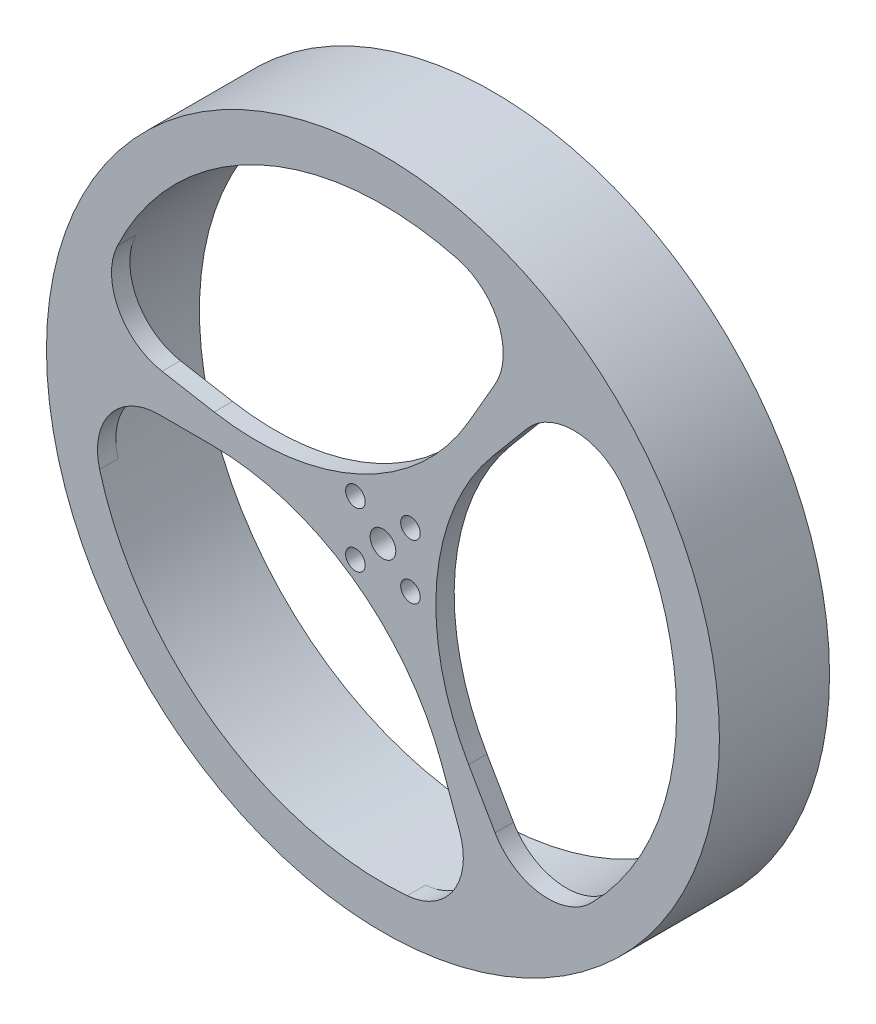
ISO-10303-21;
HEADER;
FILE_DESCRIPTION(('STEP AP214'),'2;1');
FILE_NAME('part.step','',(''),(''),'','','');
FILE_SCHEMA(('AUTOMOTIVE_DESIGN { 1 0 10303 214 1 1 1 1 }'));
ENDSEC;
DATA;
#1=APPLICATION_CONTEXT('core data for automotive mechanical design processes');
#2=APPLICATION_PROTOCOL_DEFINITION('international standard','automotive_design',2000,#1);
#3=PRODUCT_CONTEXT('',#1,'mechanical');
#4=PRODUCT('Part','Part','',(#3));
#5=PRODUCT_RELATED_PRODUCT_CATEGORY('part','',(#4));
#6=PRODUCT_DEFINITION_FORMATION('','',#4);
#7=PRODUCT_DEFINITION_CONTEXT('part definition',#1,'design');
#8=PRODUCT_DEFINITION('design','',#6,#7);
#9=PRODUCT_DEFINITION_SHAPE('','',#8);
#10=(LENGTH_UNIT() NAMED_UNIT(*) SI_UNIT(.MILLI.,.METRE.));
#11=(NAMED_UNIT(*) PLANE_ANGLE_UNIT() SI_UNIT($,.RADIAN.));
#12=(NAMED_UNIT(*) SI_UNIT($,.STERADIAN.) SOLID_ANGLE_UNIT());
#13=UNCERTAINTY_MEASURE_WITH_UNIT(LENGTH_MEASURE(1.E-05),#10,'distance_accuracy_value','');
#14=(GEOMETRIC_REPRESENTATION_CONTEXT(3) GLOBAL_UNCERTAINTY_ASSIGNED_CONTEXT((#13)) GLOBAL_UNIT_ASSIGNED_CONTEXT((#10,
#11,#12)) REPRESENTATION_CONTEXT('',''));
#15=CARTESIAN_POINT('',(0.,0.,0.));
#16=DIRECTION('',(0.,0.,1.));
#17=DIRECTION('',(1.,0.,0.));
#18=AXIS2_PLACEMENT_3D('',#15,#16,#17);
#19=CARTESIAN_POINT('',(0.,0.,0.));
#20=DIRECTION('',(0.,0.,1.));
#21=DIRECTION('',(1.,0.,0.));
#22=AXIS2_PLACEMENT_3D('',#19,#20,#21);
#23=PLANE('',#22);
#24=CARTESIAN_POINT('',(0.,0.,0.));
#25=DIRECTION('',(0.,0.,1.));
#26=DIRECTION('',(1.,0.,0.));
#27=AXIS2_PLACEMENT_3D('',#24,#25,#26);
#28=CIRCLE('',#27,55.);
#29=CARTESIAN_POINT('',(55.,0.,0.));
#30=VERTEX_POINT('',#29);
#31=EDGE_CURVE('E370',#30,#30,#28,.T.);
#32=ORIENTED_EDGE('',*,*,#31,.F.);
#33=EDGE_LOOP('',(#32));
#34=FACE_BOUND('',#33,.T.);
#35=CARTESIAN_POINT('',(0.,0.,0.));
#36=DIRECTION('',(0.,0.,1.));
#37=DIRECTION('',(1.,0.,0.));
#38=AXIS2_PLACEMENT_3D('',#35,#36,#37);
#39=CIRCLE('',#38,48.);
#40=CARTESIAN_POINT('',(48.,0.,0.));
#41=VERTEX_POINT('',#40);
#42=EDGE_CURVE('E349',#41,#41,#39,.F.);
#43=ORIENTED_EDGE('',*,*,#42,.F.);
#44=EDGE_LOOP('',(#43));
#45=FACE_BOUND('',#44,.T.);
#46=ADVANCED_FACE('F84',(#34,#45),#23,.F.);
#47=CARTESIAN_POINT('',(0.,0.,18.));
#48=DIRECTION('',(0.,0.,1.));
#49=DIRECTION('',(1.,0.,0.));
#50=AXIS2_PLACEMENT_3D('',#47,#48,#49);
#51=PLANE('',#50);
#52=CARTESIAN_POINT('',(4.49999999999996,-4.50000000000005,18.));
#53=DIRECTION('',(0.,0.,1.));
#54=DIRECTION('',(1.,0.,0.));
#55=AXIS2_PLACEMENT_3D('',#52,#53,#54);
#56=CIRCLE('',#55,1.6);
#57=CARTESIAN_POINT('',(6.09999999999996,-4.50000000000005,18.));
#58=VERTEX_POINT('',#57);
#59=EDGE_CURVE('E658',#58,#58,#56,.T.);
#60=ORIENTED_EDGE('',*,*,#59,.F.);
#61=EDGE_LOOP('',(#60));
#62=FACE_BOUND('',#61,.T.);
#63=CARTESIAN_POINT('',(4.50000000000003,4.49999999999997,18.));
#64=DIRECTION('',(0.,0.,1.));
#65=DIRECTION('',(1.,0.,0.));
#66=AXIS2_PLACEMENT_3D('',#63,#64,#65);
#67=CIRCLE('',#66,1.6);
#68=CARTESIAN_POINT('',(6.10000000000003,4.49999999999997,18.));
#69=VERTEX_POINT('',#68);
#70=EDGE_CURVE('E659',#69,#69,#67,.T.);
#71=ORIENTED_EDGE('',*,*,#70,.F.);
#72=EDGE_LOOP('',(#71));
#73=FACE_BOUND('',#72,.T.);
#74=CARTESIAN_POINT('',(-4.49999999999999,4.50000000000002,18.));
#75=DIRECTION('',(0.,0.,1.));
#76=DIRECTION('',(1.,0.,0.));
#77=AXIS2_PLACEMENT_3D('',#74,#75,#76);
#78=CIRCLE('',#77,1.6);
#79=CARTESIAN_POINT('',(-2.89999999999999,4.50000000000002,18.));
#80=VERTEX_POINT('',#79);
#81=EDGE_CURVE('E662',#80,#80,#78,.T.);
#82=ORIENTED_EDGE('',*,*,#81,.F.);
#83=EDGE_LOOP('',(#82));
#84=FACE_BOUND('',#83,.T.);
#85=CARTESIAN_POINT('',(-4.5,-4.5,18.));
#86=DIRECTION('',(0.,0.,1.));
#87=DIRECTION('',(1.,0.,0.));
#88=AXIS2_PLACEMENT_3D('',#85,#86,#87);
#89=CIRCLE('',#88,1.6);
#90=CARTESIAN_POINT('',(-2.9,-4.5,18.));
#91=VERTEX_POINT('',#90);
#92=EDGE_CURVE('E313',#91,#91,#89,.T.);
#93=ORIENTED_EDGE('',*,*,#92,.F.);
#94=EDGE_LOOP('',(#93));
#95=FACE_BOUND('',#94,.T.);
#96=CARTESIAN_POINT('',(0.,0.,18.));
#97=DIRECTION('',(0.,0.,1.));
#98=DIRECTION('',(1.,0.,0.));
#99=AXIS2_PLACEMENT_3D('',#96,#97,#98);
#100=CIRCLE('',#99,2.1);
#101=CARTESIAN_POINT('',(2.1,0.,18.));
#102=VERTEX_POINT('',#101);
#103=EDGE_CURVE('E367',#102,#102,#100,.T.);
#104=ORIENTED_EDGE('',*,*,#103,.F.);
#105=EDGE_LOOP('',(#104));
#106=FACE_BOUND('',#105,.T.);
#107=CARTESIAN_POINT('',(0.,0.,18.));
#108=DIRECTION('',(0.,0.,1.));
#109=DIRECTION('',(1.,0.,0.));
#110=AXIS2_PLACEMENT_3D('',#107,#108,#109);
#111=CIRCLE('',#110,55.);
#112=CARTESIAN_POINT('',(55.,0.,18.));
#113=VERTEX_POINT('',#112);
#114=EDGE_CURVE('E371',#113,#113,#111,.T.);
#115=ORIENTED_EDGE('',*,*,#114,.T.);
#116=EDGE_LOOP('',(#115));
#117=FACE_BOUND('',#116,.T.);
#118=DIRECTION('',(-1.,0.,0.));
#119=VECTOR('',#118,1.);
#120=CARTESIAN_POINT('',(0.,0.,18.));
#121=LINE('',#120,#119);
#122=CARTESIAN_POINT('',(-28.0083015283884,0.,18.));
#123=VERTEX_POINT('',#122);
#124=CARTESIAN_POINT('',(-36.6606055596467,0.,18.));
#125=VERTEX_POINT('',#124);
#126=EDGE_CURVE('E352',#123,#125,#121,.T.);
#127=ORIENTED_EDGE('',*,*,#126,.F.);
#128=CARTESIAN_POINT('',(-28.0083015283884,-40.,18.));
#129=DIRECTION('',(0.,0.,1.));
#130=DIRECTION('',(1.,0.,0.));
#131=AXIS2_PLACEMENT_3D('',#128,#129,#130);
#132=CIRCLE('',#131,40.);
#133=CARTESIAN_POINT('',(9.57940330304794,-26.3191942669733,18.));
#134=VERTEX_POINT('',#133);
#135=EDGE_CURVE('E12',#123,#134,#132,.F.);
#136=ORIENTED_EDGE('',*,*,#135,.T.);
#137=DIRECTION('',(-0.342020143325668,0.939692620785909,0.));
#138=VECTOR('',#137,1.);
#139=CARTESIAN_POINT('',(0.,0.,18.));
#140=LINE('',#139,#138);
#141=CARTESIAN_POINT('',(12.5386655679162,-34.4497005179429,18.));
#142=VERTEX_POINT('',#141);
#143=EDGE_CURVE('E364',#142,#134,#140,.T.);
#144=ORIENTED_EDGE('',*,*,#143,.F.);
#145=CARTESIAN_POINT('',(3.14173936005708,-37.8699019511996,18.));
#146=DIRECTION('',(0.,0.,1.));
#147=DIRECTION('',(1.,0.,0.));
#148=AXIS2_PLACEMENT_3D('',#145,#146,#147);
#149=CIRCLE('',#148,10.);
#150=CARTESIAN_POINT('',(3.96851287586158,-47.8356656225679,18.));
#151=VERTEX_POINT('',#150);
#152=EDGE_CURVE('E256',#142,#151,#149,.F.);
#153=ORIENTED_EDGE('',*,*,#152,.T.);
#154=CARTESIAN_POINT('',(0.,0.,18.));
#155=DIRECTION('',(0.,0.,1.));
#156=DIRECTION('',(1.,0.,0.));
#157=AXIS2_PLACEMENT_3D('',#154,#155,#156);
#158=CIRCLE('',#157,48.);
#159=CARTESIAN_POINT('',(-46.3081333385011,-12.6315789473684,18.));
#160=VERTEX_POINT('',#159);
#161=EDGE_CURVE('E361',#151,#160,#158,.F.);
#162=ORIENTED_EDGE('',*,*,#161,.T.);
#163=CARTESIAN_POINT('',(-36.6606055596467,-10.,18.));
#164=DIRECTION('',(0.,0.,1.));
#165=DIRECTION('',(1.,0.,0.));
#166=AXIS2_PLACEMENT_3D('',#163,#164,#165);
#167=CIRCLE('',#166,10.);
#168=EDGE_CURVE('E261',#160,#125,#167,.F.);
#169=ORIENTED_EDGE('',*,*,#168,.T.);
#170=EDGE_LOOP('',(#127,#136,#144,#153,#162,#169));
#171=FACE_BOUND('',#170,.T.);
#172=DIRECTION('',(0.5,0.866025403784439,0.));
#173=VECTOR('',#172,1.);
#174=CARTESIAN_POINT('',(0.,0.,18.));
#175=LINE('',#174,#173);
#176=CARTESIAN_POINT('',(14.0041507641942,24.2559006404389,18.));
#177=VERTEX_POINT('',#176);
#178=CARTESIAN_POINT('',(18.3303027798234,31.7490157327751,18.));
#179=VERTEX_POINT('',#178);
#180=EDGE_CURVE('E353',#177,#179,#175,.T.);
#181=ORIENTED_EDGE('',*,*,#180,.F.);
#182=CARTESIAN_POINT('',(-20.6368653871833,44.2559006404389,18.));
#183=DIRECTION('',(0.,0.,1.));
#184=DIRECTION('',(1.,0.,0.));
#185=AXIS2_PLACEMENT_3D('',#182,#183,#184);
#186=CIRCLE('',#185,40.);
#187=CARTESIAN_POINT('',(-27.5827924938605,4.86359051995055,18.));
#188=VERTEX_POINT('',#187);
#189=EDGE_CURVE('E302',#177,#188,#186,.F.);
#190=ORIENTED_EDGE('',*,*,#189,.T.);
#191=DIRECTION('',(0.984807753012208,-0.173648177666931,0.));
#192=VECTOR('',#191,1.);
#193=CARTESIAN_POINT('',(0.,0.,18.));
#194=LINE('',#193,#192);
#195=CARTESIAN_POINT('',(-36.1036485852626,6.3660473475988,18.));
#196=VERTEX_POINT('',#195);
#197=EDGE_CURVE('E356',#196,#188,#194,.T.);
#198=ORIENTED_EDGE('',*,*,#197,.F.);
#199=CARTESIAN_POINT('',(-34.3671668085933,16.2141248777209,18.));
#200=DIRECTION('',(0.,0.,1.));
#201=DIRECTION('',(1.,0.,0.));
#202=AXIS2_PLACEMENT_3D('',#199,#200,#201);
#203=CIRCLE('',#202,10.);
#204=CARTESIAN_POINT('',(-43.4111580740125,20.4809998455422,18.));
#205=VERTEX_POINT('',#204);
#206=EDGE_CURVE('E267',#196,#205,#203,.F.);
#207=ORIENTED_EDGE('',*,*,#206,.T.);
#208=CARTESIAN_POINT('',(0.,0.,18.));
#209=DIRECTION('',(0.,0.,1.));
#210=DIRECTION('',(1.,0.,0.));
#211=AXIS2_PLACEMENT_3D('',#208,#209,#210);
#212=CIRCLE('',#211,48.);
#213=CARTESIAN_POINT('',(12.2147984109209,46.4198093466633,18.));
#214=VERTEX_POINT('',#213);
#215=EDGE_CURVE('E348',#205,#214,#212,.F.);
#216=ORIENTED_EDGE('',*,*,#215,.T.);
#217=CARTESIAN_POINT('',(9.67004874197901,36.7490157327751,18.));
#218=DIRECTION('',(0.,0.,1.));
#219=DIRECTION('',(1.,0.,0.));
#220=AXIS2_PLACEMENT_3D('',#217,#218,#219);
#221=CIRCLE('',#220,10.);
#222=EDGE_CURVE('E272',#214,#179,#221,.F.);
#223=ORIENTED_EDGE('',*,*,#222,.T.);
#224=EDGE_LOOP('',(#181,#190,#198,#207,#216,#223));
#225=FACE_BOUND('',#224,.T.);
#226=DIRECTION('',(0.5,-0.866025403784439,0.));
#227=VECTOR('',#226,1.);
#228=CARTESIAN_POINT('',(0.,0.,18.));
#229=LINE('',#228,#227);
#230=CARTESIAN_POINT('',(14.0041507641942,-24.2559006404389,18.));
#231=VERTEX_POINT('',#230);
#232=CARTESIAN_POINT('',(18.3303027798233,-31.7490157327751,18.));
#233=VERTEX_POINT('',#232);
#234=EDGE_CURVE('E346',#231,#233,#229,.T.);
#235=ORIENTED_EDGE('',*,*,#234,.F.);
#236=CARTESIAN_POINT('',(48.6451669155717,-4.25590064043891,18.));
#237=DIRECTION('',(0.,0.,1.));
#238=DIRECTION('',(1.,0.,0.));
#239=AXIS2_PLACEMENT_3D('',#236,#237,#238);
#240=CIRCLE('',#239,40.);
#241=CARTESIAN_POINT('',(18.0033891908126,21.4556037470227,18.));
#242=VERTEX_POINT('',#241);
#243=EDGE_CURVE('E306',#231,#242,#240,.F.);
#244=ORIENTED_EDGE('',*,*,#243,.T.);
#245=DIRECTION('',(0.64278760968654,0.766044443118978,0.));
#246=VECTOR('',#245,1.);
#247=CARTESIAN_POINT('',(0.,0.,18.));
#248=LINE('',#247,#246);
#249=CARTESIAN_POINT('',(23.5649830173464,28.0836531703441,18.));
#250=VERTEX_POINT('',#249);
#251=EDGE_CURVE('E222',#242,#250,#248,.T.);
#252=ORIENTED_EDGE('',*,*,#251,.T.);
#253=CARTESIAN_POINT('',(31.2254274485362,21.6557770734787,18.));
#254=DIRECTION('',(0.,0.,1.));
#255=DIRECTION('',(1.,0.,0.));
#256=AXIS2_PLACEMENT_3D('',#253,#254,#255);
#257=CIRCLE('',#256,10.);
#258=CARTESIAN_POINT('',(39.4426451981509,27.3546657770257,18.));
#259=VERTEX_POINT('',#258);
#260=EDGE_CURVE('E217',#250,#259,#257,.F.);
#261=ORIENTED_EDGE('',*,*,#260,.T.);
#262=CARTESIAN_POINT('',(0.,0.,18.));
#263=DIRECTION('',(0.,0.,1.));
#264=DIRECTION('',(1.,0.,0.));
#265=AXIS2_PLACEMENT_3D('',#262,#263,#264);
#266=CIRCLE('',#265,48.);
#267=CARTESIAN_POINT('',(34.0933349275803,-33.7882303992949,18.));
#268=VERTEX_POINT('',#267);
#269=EDGE_CURVE('E210',#259,#268,#266,.F.);
#270=ORIENTED_EDGE('',*,*,#269,.T.);
#271=CARTESIAN_POINT('',(26.9905568176677,-26.7490157327751,18.));
#272=DIRECTION('',(0.,0.,1.));
#273=DIRECTION('',(1.,0.,0.));
#274=AXIS2_PLACEMENT_3D('',#271,#272,#273);
#275=CIRCLE('',#274,10.);
#276=EDGE_CURVE('E214',#268,#233,#275,.F.);
#277=ORIENTED_EDGE('',*,*,#276,.T.);
#278=EDGE_LOOP('',(#235,#244,#252,#261,#270,#277));
#279=FACE_BOUND('',#278,.T.);
#280=ADVANCED_FACE('F213',(#62,#73,#84,#95,#106,#117,#171,#225,#279),#51,.T.);
#281=CARTESIAN_POINT('',(0.,0.,18.));
#282=DIRECTION('',(0.,0.,-1.));
#283=DIRECTION('',(-1.,0.,0.));
#284=AXIS2_PLACEMENT_3D('',#281,#282,#283);
#285=CYLINDRICAL_SURFACE('',#284,55.);
#286=ORIENTED_EDGE('',*,*,#114,.F.);
#287=EDGE_LOOP('',(#286));
#288=FACE_BOUND('',#287,.T.);
#289=ORIENTED_EDGE('',*,*,#31,.T.);
#290=EDGE_LOOP('',(#289));
#291=FACE_BOUND('',#290,.T.);
#292=ADVANCED_FACE('F453',(#288,#291),#285,.T.);
#293=CARTESIAN_POINT('',(0.,0.,0.));
#294=DIRECTION('',(0.,0.,1.));
#295=DIRECTION('',(1.,0.,0.));
#296=AXIS2_PLACEMENT_3D('',#293,#294,#295);
#297=CYLINDRICAL_SURFACE('',#296,2.1);
#298=CARTESIAN_POINT('',(0.,0.,15.));
#299=DIRECTION('',(0.,0.,1.));
#300=DIRECTION('',(1.,0.,0.));
#301=AXIS2_PLACEMENT_3D('',#298,#299,#300);
#302=CIRCLE('',#301,2.1);
#303=CARTESIAN_POINT('',(2.1,0.,15.));
#304=VERTEX_POINT('',#303);
#305=EDGE_CURVE('E223',#304,#304,#302,.F.);
#306=ORIENTED_EDGE('',*,*,#305,.T.);
#307=EDGE_LOOP('',(#306));
#308=FACE_BOUND('',#307,.T.);
#309=ORIENTED_EDGE('',*,*,#103,.T.);
#310=EDGE_LOOP('',(#309));
#311=FACE_BOUND('',#310,.T.);
#312=ADVANCED_FACE('F462',(#308,#311),#297,.F.);
#313=CARTESIAN_POINT('',(0.,0.,0.));
#314=DIRECTION('',(0.939692620785909,0.342020143325668,0.));
#315=DIRECTION('',(-0.342020143325668,0.939692620785909,0.));
#316=AXIS2_PLACEMENT_3D('',#313,#314,#315);
#317=PLANE('',#316);
#318=ORIENTED_EDGE('',*,*,#143,.T.);
#319=DIRECTION('',(0.,0.,-1.));
#320=VECTOR('',#319,1.);
#321=CARTESIAN_POINT('',(9.57940330304794,-26.3191942669733,15.));
#322=LINE('',#321,#320);
#323=CARTESIAN_POINT('',(9.57940330304794,-26.3191942669733,15.));
#324=VERTEX_POINT('',#323);
#325=EDGE_CURVE('E296',#134,#324,#322,.T.);
#326=ORIENTED_EDGE('',*,*,#325,.T.);
#327=DIRECTION('',(0.342020143325668,-0.939692620785909,0.));
#328=VECTOR('',#327,1.);
#329=CARTESIAN_POINT('',(0.,0.,15.));
#330=LINE('',#329,#328);
#331=CARTESIAN_POINT('',(12.5386655679162,-34.4497005179429,15.));
#332=VERTEX_POINT('',#331);
#333=EDGE_CURVE('E329',#324,#332,#330,.T.);
#334=ORIENTED_EDGE('',*,*,#333,.T.);
#335=DIRECTION('',(0.,0.,1.));
#336=VECTOR('',#335,1.);
#337=CARTESIAN_POINT('',(12.5386655679162,-34.4497005179429,0.));
#338=LINE('',#337,#336);
#339=EDGE_CURVE('E241',#332,#142,#338,.T.);
#340=ORIENTED_EDGE('',*,*,#339,.T.);
#341=EDGE_LOOP('',(#318,#326,#334,#340));
#342=FACE_BOUND('',#341,.T.);
#343=ADVANCED_FACE('F395',(#342),#317,.F.);
#344=CARTESIAN_POINT('',(0.,0.,0.));
#345=DIRECTION('',(0.,1.,0.));
#346=DIRECTION('',(0.,0.,1.));
#347=AXIS2_PLACEMENT_3D('',#344,#345,#346);
#348=PLANE('',#347);
#349=DIRECTION('',(1.,0.,0.));
#350=VECTOR('',#349,1.);
#351=CARTESIAN_POINT('',(0.,0.,15.));
#352=LINE('',#351,#350);
#353=CARTESIAN_POINT('',(-36.6606055596467,0.,15.));
#354=VERTEX_POINT('',#353);
#355=CARTESIAN_POINT('',(-28.0083015283884,0.,15.));
#356=VERTEX_POINT('',#355);
#357=EDGE_CURVE('E327',#354,#356,#352,.T.);
#358=ORIENTED_EDGE('',*,*,#357,.T.);
#359=DIRECTION('',(0.,0.,-1.));
#360=VECTOR('',#359,1.);
#361=CARTESIAN_POINT('',(-28.0083015283884,0.,18.));
#362=LINE('',#361,#360);
#363=EDGE_CURVE('E101',#356,#123,#362,.F.);
#364=ORIENTED_EDGE('',*,*,#363,.T.);
#365=ORIENTED_EDGE('',*,*,#126,.T.);
#366=DIRECTION('',(0.,0.,1.));
#367=VECTOR('',#366,1.);
#368=CARTESIAN_POINT('',(-36.6606055596467,0.,0.));
#369=LINE('',#368,#367);
#370=EDGE_CURVE('E249',#125,#354,#369,.F.);
#371=ORIENTED_EDGE('',*,*,#370,.T.);
#372=EDGE_LOOP('',(#358,#364,#365,#371));
#373=FACE_BOUND('',#372,.T.);
#374=ADVANCED_FACE('F434',(#373),#348,.F.);
#375=CARTESIAN_POINT('',(0.,0.,0.));
#376=DIRECTION('',(-0.866025403784439,-0.5,0.));
#377=DIRECTION('',(0.5,-0.866025403784439,0.));
#378=AXIS2_PLACEMENT_3D('',#375,#376,#377);
#379=PLANE('',#378);
#380=DIRECTION('',(-0.5,0.866025403784439,0.));
#381=VECTOR('',#380,1.);
#382=CARTESIAN_POINT('',(0.,0.,15.));
#383=LINE('',#382,#381);
#384=CARTESIAN_POINT('',(18.3303027798233,-31.7490157327751,15.));
#385=VERTEX_POINT('',#384);
#386=CARTESIAN_POINT('',(14.0041507641942,-24.2559006404389,15.));
#387=VERTEX_POINT('',#386);
#388=EDGE_CURVE('E335',#385,#387,#383,.T.);
#389=ORIENTED_EDGE('',*,*,#388,.T.);
#390=DIRECTION('',(0.,0.,-1.));
#391=VECTOR('',#390,1.);
#392=CARTESIAN_POINT('',(14.0041507641942,-24.2559006404389,0.));
#393=LINE('',#392,#391);
#394=EDGE_CURVE('E294',#387,#231,#393,.F.);
#395=ORIENTED_EDGE('',*,*,#394,.T.);
#396=ORIENTED_EDGE('',*,*,#234,.T.);
#397=DIRECTION('',(0.,0.,1.));
#398=VECTOR('',#397,1.);
#399=CARTESIAN_POINT('',(18.3303027798233,-31.7490157327751,0.));
#400=LINE('',#399,#398);
#401=EDGE_CURVE('E230',#233,#385,#400,.F.);
#402=ORIENTED_EDGE('',*,*,#401,.T.);
#403=EDGE_LOOP('',(#389,#395,#396,#402));
#404=FACE_BOUND('',#403,.T.);
#405=ADVANCED_FACE('F402',(#404),#379,.F.);
#406=CARTESIAN_POINT('',(0.,0.,0.));
#407=DIRECTION('',(0.766044443118978,-0.64278760968654,0.));
#408=DIRECTION('',(0.64278760968654,0.766044443118978,0.));
#409=AXIS2_PLACEMENT_3D('',#406,#407,#408);
#410=PLANE('',#409);
#411=ORIENTED_EDGE('',*,*,#251,.F.);
#412=DIRECTION('',(0.,0.,-1.));
#413=VECTOR('',#412,1.);
#414=CARTESIAN_POINT('',(18.0033891908126,21.4556037470227,0.));
#415=LINE('',#414,#413);
#416=CARTESIAN_POINT('',(18.0033891908126,21.4556037470227,15.));
#417=VERTEX_POINT('',#416);
#418=EDGE_CURVE('E291',#242,#417,#415,.T.);
#419=ORIENTED_EDGE('',*,*,#418,.T.);
#420=DIRECTION('',(-0.64278760968654,-0.766044443118978,0.));
#421=VECTOR('',#420,1.);
#422=CARTESIAN_POINT('',(0.,0.,15.));
#423=LINE('',#422,#421);
#424=CARTESIAN_POINT('',(23.5649830173464,28.0836531703441,15.));
#425=VERTEX_POINT('',#424);
#426=EDGE_CURVE('E330',#425,#417,#423,.T.);
#427=ORIENTED_EDGE('',*,*,#426,.F.);
#428=DIRECTION('',(0.,0.,-1.));
#429=VECTOR('',#428,1.);
#430=CARTESIAN_POINT('',(23.5649830173464,28.0836531703441,18.));
#431=LINE('',#430,#429);
#432=EDGE_CURVE('E278',#425,#250,#431,.F.);
#433=ORIENTED_EDGE('',*,*,#432,.T.);
#434=EDGE_LOOP('',(#411,#419,#427,#433));
#435=FACE_BOUND('',#434,.T.);
#436=ADVANCED_FACE('F409',(#435),#410,.T.);
#437=CARTESIAN_POINT('',(0.,0.,0.));
#438=DIRECTION('',(0.,0.,1.));
#439=DIRECTION('',(1.,0.,0.));
#440=AXIS2_PLACEMENT_3D('',#437,#438,#439);
#441=CYLINDRICAL_SURFACE('',#440,48.);
#442=ORIENTED_EDGE('',*,*,#269,.F.);
#443=DIRECTION('',(0.,0.,1.));
#444=VECTOR('',#443,1.);
#445=CARTESIAN_POINT('',(39.442645198151,27.3546657770257,0.));
#446=LINE('',#445,#444);
#447=CARTESIAN_POINT('',(39.4426451981509,27.3546657770257,15.));
#448=VERTEX_POINT('',#447);
#449=EDGE_CURVE('E281',#259,#448,#446,.F.);
#450=ORIENTED_EDGE('',*,*,#449,.T.);
#451=CARTESIAN_POINT('',(0.,0.,15.));
#452=DIRECTION('',(0.,0.,1.));
#453=DIRECTION('',(1.,0.,0.));
#454=AXIS2_PLACEMENT_3D('',#451,#452,#453);
#455=CIRCLE('',#454,48.);
#456=CARTESIAN_POINT('',(12.2147984109209,46.4198093466633,15.));
#457=VERTEX_POINT('',#456);
#458=EDGE_CURVE('E324',#448,#457,#455,.T.);
#459=ORIENTED_EDGE('',*,*,#458,.T.);
#460=DIRECTION('',(0.,0.,1.));
#461=VECTOR('',#460,1.);
#462=CARTESIAN_POINT('',(12.2147984109209,46.4198093466633,0.));
#463=LINE('',#462,#461);
#464=EDGE_CURVE('E374',#457,#214,#463,.T.);
#465=ORIENTED_EDGE('',*,*,#464,.T.);
#466=ORIENTED_EDGE('',*,*,#215,.F.);
#467=DIRECTION('',(0.,0.,1.));
#468=VECTOR('',#467,1.);
#469=CARTESIAN_POINT('',(-43.4111580740125,20.4809998455422,0.));
#470=LINE('',#469,#468);
#471=CARTESIAN_POINT('',(-43.4111580740125,20.4809998455422,15.));
#472=VERTEX_POINT('',#471);
#473=EDGE_CURVE('E378',#205,#472,#470,.F.);
#474=ORIENTED_EDGE('',*,*,#473,.T.);
#475=CARTESIAN_POINT('',(-46.3081333385011,-12.6315789473684,15.));
#476=VERTEX_POINT('',#475);
#477=EDGE_CURVE('E322',#472,#476,#455,.T.);
#478=ORIENTED_EDGE('',*,*,#477,.T.);
#479=DIRECTION('',(0.,0.,1.));
#480=VECTOR('',#479,1.);
#481=CARTESIAN_POINT('',(-46.3081333385011,-12.6315789473684,0.));
#482=LINE('',#481,#480);
#483=EDGE_CURVE('E243',#476,#160,#482,.T.);
#484=ORIENTED_EDGE('',*,*,#483,.T.);
#485=ORIENTED_EDGE('',*,*,#161,.F.);
#486=DIRECTION('',(0.,0.,1.));
#487=VECTOR('',#486,1.);
#488=CARTESIAN_POINT('',(3.96851287586158,-47.8356656225679,0.));
#489=LINE('',#488,#487);
#490=CARTESIAN_POINT('',(3.96851287586158,-47.8356656225679,15.));
#491=VERTEX_POINT('',#490);
#492=EDGE_CURVE('E239',#151,#491,#489,.F.);
#493=ORIENTED_EDGE('',*,*,#492,.T.);
#494=CARTESIAN_POINT('',(34.0933349275803,-33.7882303992949,15.));
#495=VERTEX_POINT('',#494);
#496=EDGE_CURVE('E237',#491,#495,#455,.T.);
#497=ORIENTED_EDGE('',*,*,#496,.T.);
#498=DIRECTION('',(0.,0.,1.));
#499=VECTOR('',#498,1.);
#500=CARTESIAN_POINT('',(34.0933349275803,-33.7882303992949,0.));
#501=LINE('',#500,#499);
#502=EDGE_CURVE('E229',#495,#268,#501,.T.);
#503=ORIENTED_EDGE('',*,*,#502,.T.);
#504=EDGE_LOOP('',(#442,#450,#459,#465,#466,#474,#478,#484,#485,#493,#497,#503));
#505=FACE_BOUND('',#504,.T.);
#506=ORIENTED_EDGE('',*,*,#42,.T.);
#507=EDGE_LOOP('',(#506));
#508=FACE_BOUND('',#507,.T.);
#509=ADVANCED_FACE('F234',(#505,#508),#441,.F.);
#510=CARTESIAN_POINT('',(0.,0.,0.));
#511=DIRECTION('',(0.866025403784439,-0.5,0.));
#512=DIRECTION('',(0.5,0.866025403784439,0.));
#513=AXIS2_PLACEMENT_3D('',#510,#511,#512);
#514=PLANE('',#513);
#515=DIRECTION('',(-0.5,-0.866025403784439,0.));
#516=VECTOR('',#515,1.);
#517=CARTESIAN_POINT('',(0.,0.,15.));
#518=LINE('',#517,#516);
#519=CARTESIAN_POINT('',(18.3303027798234,31.7490157327751,15.));
#520=VERTEX_POINT('',#519);
#521=CARTESIAN_POINT('',(14.0041507641942,24.2559006404389,15.));
#522=VERTEX_POINT('',#521);
#523=EDGE_CURVE('E340',#520,#522,#518,.T.);
#524=ORIENTED_EDGE('',*,*,#523,.T.);
#525=DIRECTION('',(0.,0.,-1.));
#526=VECTOR('',#525,1.);
#527=CARTESIAN_POINT('',(14.0041507641942,24.2559006404389,18.));
#528=LINE('',#527,#526);
#529=EDGE_CURVE('E289',#522,#177,#528,.F.);
#530=ORIENTED_EDGE('',*,*,#529,.T.);
#531=ORIENTED_EDGE('',*,*,#180,.T.);
#532=DIRECTION('',(0.,0.,1.));
#533=VECTOR('',#532,1.);
#534=CARTESIAN_POINT('',(18.3303027798234,31.7490157327751,0.));
#535=LINE('',#534,#533);
#536=EDGE_CURVE('E232',#179,#520,#535,.F.);
#537=ORIENTED_EDGE('',*,*,#536,.T.);
#538=EDGE_LOOP('',(#524,#530,#531,#537));
#539=FACE_BOUND('',#538,.T.);
#540=ADVANCED_FACE('F483',(#539),#514,.F.);
#541=CARTESIAN_POINT('',(0.,0.,0.));
#542=DIRECTION('',(-0.173648177666931,-0.984807753012208,0.));
#543=DIRECTION('',(0.984807753012208,-0.173648177666931,0.));
#544=AXIS2_PLACEMENT_3D('',#541,#542,#543);
#545=PLANE('',#544);
#546=ORIENTED_EDGE('',*,*,#197,.T.);
#547=DIRECTION('',(0.,0.,-1.));
#548=VECTOR('',#547,1.);
#549=CARTESIAN_POINT('',(-27.5827924938605,4.86359051995055,15.));
#550=LINE('',#549,#548);
#551=CARTESIAN_POINT('',(-27.5827924938605,4.86359051995055,15.));
#552=VERTEX_POINT('',#551);
#553=EDGE_CURVE('E286',#188,#552,#550,.T.);
#554=ORIENTED_EDGE('',*,*,#553,.T.);
#555=DIRECTION('',(-0.984807753012208,0.173648177666931,0.));
#556=VECTOR('',#555,1.);
#557=CARTESIAN_POINT('',(0.,0.,15.));
#558=LINE('',#557,#556);
#559=CARTESIAN_POINT('',(-36.1036485852626,6.3660473475988,15.));
#560=VERTEX_POINT('',#559);
#561=EDGE_CURVE('E338',#552,#560,#558,.T.);
#562=ORIENTED_EDGE('',*,*,#561,.T.);
#563=DIRECTION('',(0.,0.,1.));
#564=VECTOR('',#563,1.);
#565=CARTESIAN_POINT('',(-36.1036485852626,6.3660473475988,0.));
#566=LINE('',#565,#564);
#567=EDGE_CURVE('E251',#560,#196,#566,.T.);
#568=ORIENTED_EDGE('',*,*,#567,.T.);
#569=EDGE_LOOP('',(#546,#554,#562,#568));
#570=FACE_BOUND('',#569,.T.);
#571=ADVANCED_FACE('F430',(#570),#545,.F.);
#572=CARTESIAN_POINT('',(0.,0.,15.));
#573=DIRECTION('',(0.,0.,1.));
#574=DIRECTION('',(1.,0.,0.));
#575=AXIS2_PLACEMENT_3D('',#572,#573,#574);
#576=PLANE('',#575);
#577=CARTESIAN_POINT('',(4.49999999999996,-4.50000000000005,15.));
#578=DIRECTION('',(0.,0.,1.));
#579=DIRECTION('',(1.,0.,0.));
#580=AXIS2_PLACEMENT_3D('',#577,#578,#579);
#581=CIRCLE('',#580,1.6);
#582=CARTESIAN_POINT('',(6.09999999999996,-4.50000000000005,15.));
#583=VERTEX_POINT('',#582);
#584=EDGE_CURVE('E88',#583,#583,#581,.F.);
#585=ORIENTED_EDGE('',*,*,#584,.F.);
#586=EDGE_LOOP('',(#585));
#587=FACE_BOUND('',#586,.T.);
#588=CARTESIAN_POINT('',(4.50000000000003,4.49999999999997,15.));
#589=DIRECTION('',(0.,0.,1.));
#590=DIRECTION('',(1.,0.,0.));
#591=AXIS2_PLACEMENT_3D('',#588,#589,#590);
#592=CIRCLE('',#591,1.6);
#593=CARTESIAN_POINT('',(6.10000000000003,4.49999999999997,15.));
#594=VERTEX_POINT('',#593);
#595=EDGE_CURVE('E315',#594,#594,#592,.F.);
#596=ORIENTED_EDGE('',*,*,#595,.F.);
#597=EDGE_LOOP('',(#596));
#598=FACE_BOUND('',#597,.T.);
#599=CARTESIAN_POINT('',(-4.49999999999999,4.50000000000002,15.));
#600=DIRECTION('',(0.,0.,1.));
#601=DIRECTION('',(1.,0.,0.));
#602=AXIS2_PLACEMENT_3D('',#599,#600,#601);
#603=CIRCLE('',#602,1.6);
#604=CARTESIAN_POINT('',(-2.89999999999999,4.50000000000002,15.));
#605=VERTEX_POINT('',#604);
#606=EDGE_CURVE('E312',#605,#605,#603,.F.);
#607=ORIENTED_EDGE('',*,*,#606,.F.);
#608=EDGE_LOOP('',(#607));
#609=FACE_BOUND('',#608,.T.);
#610=CARTESIAN_POINT('',(-4.5,-4.5,15.));
#611=DIRECTION('',(0.,0.,1.));
#612=DIRECTION('',(1.,0.,0.));
#613=AXIS2_PLACEMENT_3D('',#610,#611,#612);
#614=CIRCLE('',#613,1.6);
#615=CARTESIAN_POINT('',(-2.9,-4.5,15.));
#616=VERTEX_POINT('',#615);
#617=EDGE_CURVE('E309',#616,#616,#614,.F.);
#618=ORIENTED_EDGE('',*,*,#617,.F.);
#619=EDGE_LOOP('',(#618));
#620=FACE_BOUND('',#619,.T.);
#621=ORIENTED_EDGE('',*,*,#458,.F.);
#622=CARTESIAN_POINT('',(31.2254274485362,21.6557770734787,15.));
#623=DIRECTION('',(0.,0.,1.));
#624=DIRECTION('',(1.,0.,0.));
#625=AXIS2_PLACEMENT_3D('',#622,#623,#624);
#626=CIRCLE('',#625,10.);
#627=EDGE_CURVE('E284',#448,#425,#626,.T.);
#628=ORIENTED_EDGE('',*,*,#627,.T.);
#629=ORIENTED_EDGE('',*,*,#426,.T.);
#630=CARTESIAN_POINT('',(48.6451669155717,-4.25590064043891,15.));
#631=DIRECTION('',(0.,0.,1.));
#632=DIRECTION('',(1.,0.,0.));
#633=AXIS2_PLACEMENT_3D('',#630,#631,#632);
#634=CIRCLE('',#633,40.);
#635=EDGE_CURVE('E304',#417,#387,#634,.T.);
#636=ORIENTED_EDGE('',*,*,#635,.T.);
#637=ORIENTED_EDGE('',*,*,#388,.F.);
#638=CARTESIAN_POINT('',(26.9905568176677,-26.7490157327751,15.));
#639=DIRECTION('',(0.,0.,1.));
#640=DIRECTION('',(1.,0.,0.));
#641=AXIS2_PLACEMENT_3D('',#638,#639,#640);
#642=CIRCLE('',#641,10.);
#643=EDGE_CURVE('E231',#385,#495,#642,.T.);
#644=ORIENTED_EDGE('',*,*,#643,.T.);
#645=ORIENTED_EDGE('',*,*,#496,.F.);
#646=CARTESIAN_POINT('',(3.14173936005708,-37.8699019511996,15.));
#647=DIRECTION('',(0.,0.,1.));
#648=DIRECTION('',(1.,0.,0.));
#649=AXIS2_PLACEMENT_3D('',#646,#647,#648);
#650=CIRCLE('',#649,10.);
#651=EDGE_CURVE('E258',#491,#332,#650,.T.);
#652=ORIENTED_EDGE('',*,*,#651,.T.);
#653=ORIENTED_EDGE('',*,*,#333,.F.);
#654=CARTESIAN_POINT('',(-28.0083015283884,-40.,15.));
#655=DIRECTION('',(0.,0.,1.));
#656=DIRECTION('',(1.,0.,0.));
#657=AXIS2_PLACEMENT_3D('',#654,#655,#656);
#658=CIRCLE('',#657,40.);
#659=EDGE_CURVE('E93',#324,#356,#658,.T.);
#660=ORIENTED_EDGE('',*,*,#659,.T.);
#661=ORIENTED_EDGE('',*,*,#357,.F.);
#662=CARTESIAN_POINT('',(-36.6606055596467,-10.,15.));
#663=DIRECTION('',(0.,0.,1.));
#664=DIRECTION('',(1.,0.,0.));
#665=AXIS2_PLACEMENT_3D('',#662,#663,#664);
#666=CIRCLE('',#665,10.);
#667=EDGE_CURVE('E264',#354,#476,#666,.T.);
#668=ORIENTED_EDGE('',*,*,#667,.T.);
#669=ORIENTED_EDGE('',*,*,#477,.F.);
#670=CARTESIAN_POINT('',(-34.3671668085933,16.2141248777209,15.));
#671=DIRECTION('',(0.,0.,1.));
#672=DIRECTION('',(1.,0.,0.));
#673=AXIS2_PLACEMENT_3D('',#670,#671,#672);
#674=CIRCLE('',#673,10.);
#675=EDGE_CURVE('E269',#472,#560,#674,.T.);
#676=ORIENTED_EDGE('',*,*,#675,.T.);
#677=ORIENTED_EDGE('',*,*,#561,.F.);
#678=CARTESIAN_POINT('',(-20.6368653871833,44.2559006404389,15.));
#679=DIRECTION('',(0.,0.,1.));
#680=DIRECTION('',(1.,0.,0.));
#681=AXIS2_PLACEMENT_3D('',#678,#679,#680);
#682=CIRCLE('',#681,40.);
#683=EDGE_CURVE('E300',#552,#522,#682,.T.);
#684=ORIENTED_EDGE('',*,*,#683,.T.);
#685=ORIENTED_EDGE('',*,*,#523,.F.);
#686=CARTESIAN_POINT('',(9.67004874197901,36.7490157327751,15.));
#687=DIRECTION('',(0.,0.,1.));
#688=DIRECTION('',(1.,0.,0.));
#689=AXIS2_PLACEMENT_3D('',#686,#687,#688);
#690=CIRCLE('',#689,10.);
#691=EDGE_CURVE('E275',#520,#457,#690,.T.);
#692=ORIENTED_EDGE('',*,*,#691,.T.);
#693=EDGE_LOOP('',(#621,#628,#629,#636,#637,#644,#645,#652,#653,#660,#661,#668,#669,#676,#677,
#684,#685,#692));
#694=FACE_BOUND('',#693,.T.);
#695=ORIENTED_EDGE('',*,*,#305,.F.);
#696=EDGE_LOOP('',(#695));
#697=FACE_BOUND('',#696,.T.);
#698=ADVANCED_FACE('F397',(#587,#598,#609,#620,#694,#697),#576,.F.);
#699=CARTESIAN_POINT('',(26.9905568176677,-26.7490157327751,0.));
#700=DIRECTION('',(0.,0.,1.));
#701=DIRECTION('',(1.,0.,0.));
#702=AXIS2_PLACEMENT_3D('',#699,#700,#701);
#703=CYLINDRICAL_SURFACE('',#702,10.);
#704=ORIENTED_EDGE('',*,*,#643,.F.);
#705=ORIENTED_EDGE('',*,*,#401,.F.);
#706=ORIENTED_EDGE('',*,*,#276,.F.);
#707=ORIENTED_EDGE('',*,*,#502,.F.);
#708=EDGE_LOOP('',(#704,#705,#706,#707));
#709=FACE_BOUND('',#708,.T.);
#710=ADVANCED_FACE('F228',(#709),#703,.F.);
#711=CARTESIAN_POINT('',(3.14173936005708,-37.8699019511996,0.));
#712=DIRECTION('',(0.,0.,1.));
#713=DIRECTION('',(1.,0.,0.));
#714=AXIS2_PLACEMENT_3D('',#711,#712,#713);
#715=CYLINDRICAL_SURFACE('',#714,10.);
#716=ORIENTED_EDGE('',*,*,#651,.F.);
#717=ORIENTED_EDGE('',*,*,#492,.F.);
#718=ORIENTED_EDGE('',*,*,#152,.F.);
#719=ORIENTED_EDGE('',*,*,#339,.F.);
#720=EDGE_LOOP('',(#716,#717,#718,#719));
#721=FACE_BOUND('',#720,.T.);
#722=ADVANCED_FACE('F393',(#721),#715,.F.);
#723=CARTESIAN_POINT('',(-36.6606055596467,-10.,0.));
#724=DIRECTION('',(0.,0.,1.));
#725=DIRECTION('',(1.,0.,0.));
#726=AXIS2_PLACEMENT_3D('',#723,#724,#725);
#727=CYLINDRICAL_SURFACE('',#726,10.);
#728=ORIENTED_EDGE('',*,*,#667,.F.);
#729=ORIENTED_EDGE('',*,*,#370,.F.);
#730=ORIENTED_EDGE('',*,*,#168,.F.);
#731=ORIENTED_EDGE('',*,*,#483,.F.);
#732=EDGE_LOOP('',(#728,#729,#730,#731));
#733=FACE_BOUND('',#732,.T.);
#734=ADVANCED_FACE('F433',(#733),#727,.F.);
#735=CARTESIAN_POINT('',(-34.3671668085933,16.2141248777209,0.));
#736=DIRECTION('',(0.,0.,1.));
#737=DIRECTION('',(1.,0.,0.));
#738=AXIS2_PLACEMENT_3D('',#735,#736,#737);
#739=CYLINDRICAL_SURFACE('',#738,10.);
#740=ORIENTED_EDGE('',*,*,#675,.F.);
#741=ORIENTED_EDGE('',*,*,#473,.F.);
#742=ORIENTED_EDGE('',*,*,#206,.F.);
#743=ORIENTED_EDGE('',*,*,#567,.F.);
#744=EDGE_LOOP('',(#740,#741,#742,#743));
#745=FACE_BOUND('',#744,.T.);
#746=ADVANCED_FACE('F428',(#745),#739,.F.);
#747=CARTESIAN_POINT('',(9.67004874197901,36.7490157327751,0.));
#748=DIRECTION('',(0.,0.,1.));
#749=DIRECTION('',(1.,0.,0.));
#750=AXIS2_PLACEMENT_3D('',#747,#748,#749);
#751=CYLINDRICAL_SURFACE('',#750,10.);
#752=ORIENTED_EDGE('',*,*,#691,.F.);
#753=ORIENTED_EDGE('',*,*,#536,.F.);
#754=ORIENTED_EDGE('',*,*,#222,.F.);
#755=ORIENTED_EDGE('',*,*,#464,.F.);
#756=EDGE_LOOP('',(#752,#753,#754,#755));
#757=FACE_BOUND('',#756,.T.);
#758=ADVANCED_FACE('F420',(#757),#751,.F.);
#759=CARTESIAN_POINT('',(31.2254274485362,21.6557770734787,0.));
#760=DIRECTION('',(0.,0.,1.));
#761=DIRECTION('',(1.,0.,0.));
#762=AXIS2_PLACEMENT_3D('',#759,#760,#761);
#763=CYLINDRICAL_SURFACE('',#762,10.);
#764=ORIENTED_EDGE('',*,*,#627,.F.);
#765=ORIENTED_EDGE('',*,*,#449,.F.);
#766=ORIENTED_EDGE('',*,*,#260,.F.);
#767=ORIENTED_EDGE('',*,*,#432,.F.);
#768=EDGE_LOOP('',(#764,#765,#766,#767));
#769=FACE_BOUND('',#768,.T.);
#770=ADVANCED_FACE('F414',(#769),#763,.F.);
#771=CARTESIAN_POINT('',(-20.6368653871833,44.2559006404389,0.));
#772=DIRECTION('',(0.,0.,1.));
#773=DIRECTION('',(1.,0.,0.));
#774=AXIS2_PLACEMENT_3D('',#771,#772,#773);
#775=CYLINDRICAL_SURFACE('',#774,40.);
#776=ORIENTED_EDGE('',*,*,#189,.F.);
#777=ORIENTED_EDGE('',*,*,#529,.F.);
#778=ORIENTED_EDGE('',*,*,#683,.F.);
#779=ORIENTED_EDGE('',*,*,#553,.F.);
#780=EDGE_LOOP('',(#776,#777,#778,#779));
#781=FACE_BOUND('',#780,.T.);
#782=ADVANCED_FACE('F446',(#781),#775,.F.);
#783=CARTESIAN_POINT('',(48.6451669155717,-4.25590064043891,0.));
#784=DIRECTION('',(0.,0.,-1.));
#785=DIRECTION('',(-1.,0.,0.));
#786=AXIS2_PLACEMENT_3D('',#783,#784,#785);
#787=CYLINDRICAL_SURFACE('',#786,40.);
#788=ORIENTED_EDGE('',*,*,#243,.F.);
#789=ORIENTED_EDGE('',*,*,#394,.F.);
#790=ORIENTED_EDGE('',*,*,#635,.F.);
#791=ORIENTED_EDGE('',*,*,#418,.F.);
#792=EDGE_LOOP('',(#788,#789,#790,#791));
#793=FACE_BOUND('',#792,.T.);
#794=ADVANCED_FACE('F405',(#793),#787,.F.);
#795=CARTESIAN_POINT('',(-28.0083015283884,-40.,0.));
#796=DIRECTION('',(0.,0.,1.));
#797=DIRECTION('',(1.,0.,0.));
#798=AXIS2_PLACEMENT_3D('',#795,#796,#797);
#799=CYLINDRICAL_SURFACE('',#798,40.);
#800=ORIENTED_EDGE('',*,*,#135,.F.);
#801=ORIENTED_EDGE('',*,*,#363,.F.);
#802=ORIENTED_EDGE('',*,*,#659,.F.);
#803=ORIENTED_EDGE('',*,*,#325,.F.);
#804=EDGE_LOOP('',(#800,#801,#802,#803));
#805=FACE_BOUND('',#804,.T.);
#806=ADVANCED_FACE('F86',(#805),#799,.F.);
#807=CARTESIAN_POINT('',(-4.5,-4.5,18.));
#808=DIRECTION('',(0.,0.,-1.));
#809=DIRECTION('',(-1.,0.,0.));
#810=AXIS2_PLACEMENT_3D('',#807,#808,#809);
#811=CYLINDRICAL_SURFACE('',#810,1.6);
#812=ORIENTED_EDGE('',*,*,#92,.T.);
#813=EDGE_LOOP('',(#812));
#814=FACE_BOUND('',#813,.T.);
#815=ORIENTED_EDGE('',*,*,#617,.T.);
#816=EDGE_LOOP('',(#815));
#817=FACE_BOUND('',#816,.T.);
#818=ADVANCED_FACE('F438',(#814,#817),#811,.F.);
#819=CARTESIAN_POINT('',(-4.49999999999999,4.50000000000002,18.));
#820=DIRECTION('',(0.,0.,-1.));
#821=DIRECTION('',(-1.,0.,0.));
#822=AXIS2_PLACEMENT_3D('',#819,#820,#821);
#823=CYLINDRICAL_SURFACE('',#822,1.6);
#824=ORIENTED_EDGE('',*,*,#81,.T.);
#825=EDGE_LOOP('',(#824));
#826=FACE_BOUND('',#825,.T.);
#827=ORIENTED_EDGE('',*,*,#606,.T.);
#828=EDGE_LOOP('',(#827));
#829=FACE_BOUND('',#828,.T.);
#830=ADVANCED_FACE('F443',(#826,#829),#823,.F.);
#831=CARTESIAN_POINT('',(4.50000000000003,4.49999999999997,18.));
#832=DIRECTION('',(0.,0.,-1.));
#833=DIRECTION('',(-1.,0.,0.));
#834=AXIS2_PLACEMENT_3D('',#831,#832,#833);
#835=CYLINDRICAL_SURFACE('',#834,1.6);
#836=ORIENTED_EDGE('',*,*,#70,.T.);
#837=EDGE_LOOP('',(#836));
#838=FACE_BOUND('',#837,.T.);
#839=ORIENTED_EDGE('',*,*,#595,.T.);
#840=EDGE_LOOP('',(#839));
#841=FACE_BOUND('',#840,.T.);
#842=ADVANCED_FACE('F633',(#838,#841),#835,.F.);
#843=CARTESIAN_POINT('',(4.49999999999996,-4.50000000000005,18.));
#844=DIRECTION('',(0.,0.,-1.));
#845=DIRECTION('',(-1.,0.,0.));
#846=AXIS2_PLACEMENT_3D('',#843,#844,#845);
#847=CYLINDRICAL_SURFACE('',#846,1.6);
#848=ORIENTED_EDGE('',*,*,#59,.T.);
#849=EDGE_LOOP('',(#848));
#850=FACE_BOUND('',#849,.T.);
#851=ORIENTED_EDGE('',*,*,#584,.T.);
#852=EDGE_LOOP('',(#851));
#853=FACE_BOUND('',#852,.T.);
#854=ADVANCED_FACE('F643',(#850,#853),#847,.F.);
#855=CLOSED_SHELL('',(#46,#280,#292,#312,#343,#374,#405,#436,#509,#540,#571,#698,#710,#722,#734,
#746,#758,#770,#782,#794,#806,#818,#830,#842,#854));
#856=MANIFOLD_SOLID_BREP('B2',#855);
#857=ADVANCED_BREP_SHAPE_REPRESENTATION('',(#18,#856),#14);
#858=SHAPE_DEFINITION_REPRESENTATION(#9,#857);
ENDSEC;
END-ISO-10303-21;
